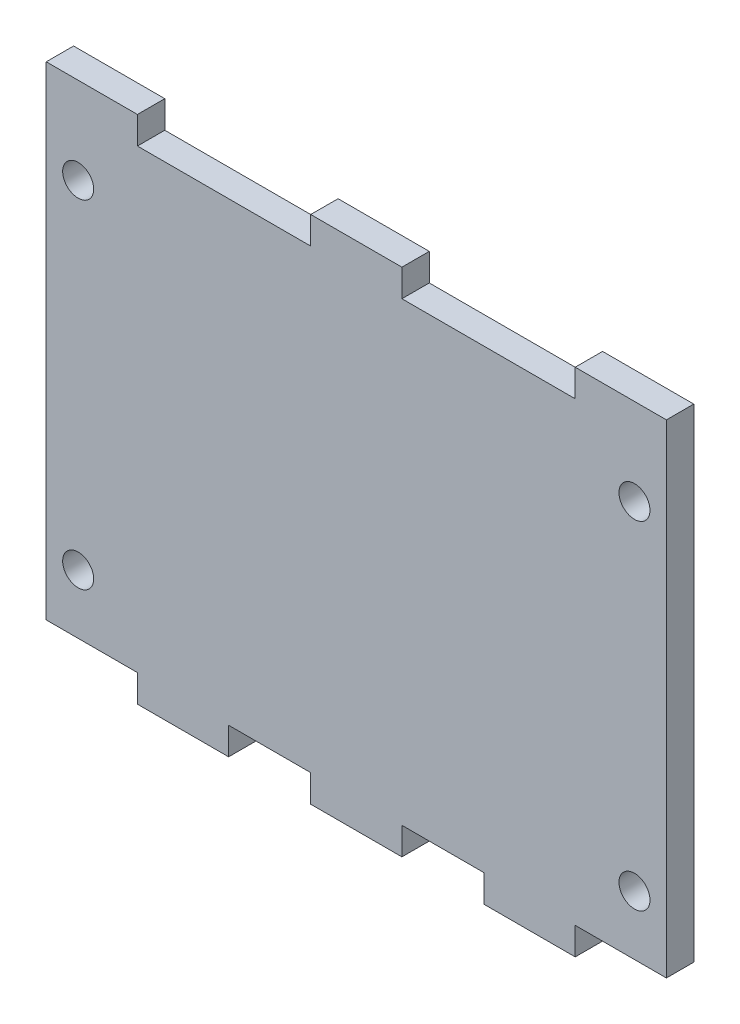
ISO-10303-21;
HEADER;
FILE_DESCRIPTION(('STEP AP214'),'2;1');
FILE_NAME('part.step','',(''),(''),'','','');
FILE_SCHEMA(('AUTOMOTIVE_DESIGN { 1 0 10303 214 1 1 1 1 }'));
ENDSEC;
DATA;
#1=APPLICATION_CONTEXT('core data for automotive mechanical design processes');
#2=APPLICATION_PROTOCOL_DEFINITION('international standard','automotive_design',2000,#1);
#3=PRODUCT_CONTEXT('',#1,'mechanical');
#4=PRODUCT('Part','Part','',(#3));
#5=PRODUCT_RELATED_PRODUCT_CATEGORY('part','',(#4));
#6=PRODUCT_DEFINITION_FORMATION('','',#4);
#7=PRODUCT_DEFINITION_CONTEXT('part definition',#1,'design');
#8=PRODUCT_DEFINITION('design','',#6,#7);
#9=PRODUCT_DEFINITION_SHAPE('','',#8);
#10=(LENGTH_UNIT() NAMED_UNIT(*) SI_UNIT(.MILLI.,.METRE.));
#11=(NAMED_UNIT(*) PLANE_ANGLE_UNIT() SI_UNIT($,.RADIAN.));
#12=(NAMED_UNIT(*) SI_UNIT($,.STERADIAN.) SOLID_ANGLE_UNIT());
#13=UNCERTAINTY_MEASURE_WITH_UNIT(LENGTH_MEASURE(1.E-05),#10,'distance_accuracy_value','');
#14=(GEOMETRIC_REPRESENTATION_CONTEXT(3) GLOBAL_UNCERTAINTY_ASSIGNED_CONTEXT((#13)) GLOBAL_UNIT_ASSIGNED_CONTEXT((#10,
#11,#12)) REPRESENTATION_CONTEXT('',''));
#15=CARTESIAN_POINT('',(0.,0.,0.));
#16=DIRECTION('',(0.,0.,1.));
#17=DIRECTION('',(1.,0.,0.));
#18=AXIS2_PLACEMENT_3D('',#15,#16,#17);
#19=CARTESIAN_POINT('',(34.,-53.,-53.));
#20=DIRECTION('',(0.,-1.,0.));
#21=DIRECTION('',(0.,0.,-1.));
#22=AXIS2_PLACEMENT_3D('',#19,#20,#21);
#23=PLANE('',#22);
#24=DIRECTION('',(1.,0.,0.));
#25=VECTOR('',#24,1.);
#26=CARTESIAN_POINT('',(34.,-53.,-50.));
#27=LINE('',#26,#25);
#28=CARTESIAN_POINT('',(-14.,-53.,-50.));
#29=VERTEX_POINT('',#28);
#30=CARTESIAN_POINT('',(-5.,-53.,-50.));
#31=VERTEX_POINT('',#30);
#32=EDGE_CURVE('E124',#29,#31,#27,.T.);
#33=ORIENTED_EDGE('',*,*,#32,.F.);
#34=CARTESIAN_POINT('',(-14.,-53.,-50.));
#35=CARTESIAN_POINT('',(-14.,-53.,-53.));
#36=B_SPLINE_CURVE_WITH_KNOTS('',1,(#34,#35),.UNSPECIFIED.,.F.,.F.,(2,2),(0.,0.115384615384615),.UNSPECIFIED.);
#37=CARTESIAN_POINT('',(-14.,-53.,-53.));
#38=VERTEX_POINT('',#37);
#39=EDGE_CURVE('E284',#29,#38,#36,.T.);
#40=ORIENTED_EDGE('',*,*,#39,.T.);
#41=DIRECTION('',(1.,0.,0.));
#42=VECTOR('',#41,1.);
#43=CARTESIAN_POINT('',(34.,-53.,-53.));
#44=LINE('',#43,#42);
#45=CARTESIAN_POINT('',(-5.,-53.,-53.));
#46=VERTEX_POINT('',#45);
#47=EDGE_CURVE('E497',#38,#46,#44,.T.);
#48=ORIENTED_EDGE('',*,*,#47,.T.);
#49=CARTESIAN_POINT('',(-5.,-53.,-53.));
#50=CARTESIAN_POINT('',(-5.,-53.,-50.));
#51=B_SPLINE_CURVE_WITH_KNOTS('',1,(#49,#50),.UNSPECIFIED.,.F.,.F.,(2,2),(0.5,
0.615384615384615),.UNSPECIFIED.);
#52=EDGE_CURVE('E298',#46,#31,#51,.T.);
#53=ORIENTED_EDGE('',*,*,#52,.T.);
#54=EDGE_LOOP('',(#33,#40,#48,#53));
#55=FACE_BOUND('',#54,.T.);
#56=ADVANCED_FACE('F101',(#55),#23,.T.);
#57=CARTESIAN_POINT('',(-34.,-53.,-53.));
#58=VERTEX_POINT('',#57);
#59=CARTESIAN_POINT('',(-24.,-53.,-53.));
#60=VERTEX_POINT('',#59);
#61=EDGE_CURVE('E494',#58,#60,#44,.T.);
#62=ORIENTED_EDGE('',*,*,#61,.T.);
#63=CARTESIAN_POINT('',(-24.,-53.,-53.));
#64=CARTESIAN_POINT('',(-24.,-53.,-50.));
#65=B_SPLINE_CURVE_WITH_KNOTS('',1,(#63,#64),.UNSPECIFIED.,.F.,.F.,(2,2),(0.5,
0.615384615384615),.UNSPECIFIED.);
#66=CARTESIAN_POINT('',(-24.,-53.,-50.));
#67=VERTEX_POINT('',#66);
#68=EDGE_CURVE('E274',#60,#67,#65,.T.);
#69=ORIENTED_EDGE('',*,*,#68,.T.);
#70=CARTESIAN_POINT('',(-34.,-53.,-50.));
#71=VERTEX_POINT('',#70);
#72=EDGE_CURVE('E505',#71,#67,#27,.T.);
#73=ORIENTED_EDGE('',*,*,#72,.F.);
#74=DIRECTION('',(0.,0.,1.));
#75=VECTOR('',#74,1.);
#76=CARTESIAN_POINT('',(-34.,-53.,-53.));
#77=LINE('',#76,#75);
#78=EDGE_CURVE('E105',#58,#71,#77,.T.);
#79=ORIENTED_EDGE('',*,*,#78,.F.);
#80=EDGE_LOOP('',(#62,#69,#73,#79));
#81=FACE_BOUND('',#80,.T.);
#82=ADVANCED_FACE('F527',(#81),#23,.T.);
#83=CARTESIAN_POINT('',(5.,-53.,-50.));
#84=VERTEX_POINT('',#83);
#85=CARTESIAN_POINT('',(14.,-53.,-50.));
#86=VERTEX_POINT('',#85);
#87=EDGE_CURVE('E578',#84,#86,#27,.T.);
#88=ORIENTED_EDGE('',*,*,#87,.F.);
#89=CARTESIAN_POINT('',(5.,-53.,-50.));
#90=CARTESIAN_POINT('',(5.,-53.,-53.));
#91=B_SPLINE_CURVE_WITH_KNOTS('',1,(#89,#90),.UNSPECIFIED.,.F.,.F.,(2,2),(0.,0.115384615384615),.UNSPECIFIED.);
#92=CARTESIAN_POINT('',(5.,-53.,-53.));
#93=VERTEX_POINT('',#92);
#94=EDGE_CURVE('E297',#84,#93,#91,.T.);
#95=ORIENTED_EDGE('',*,*,#94,.T.);
#96=CARTESIAN_POINT('',(14.,-53.,-53.));
#97=VERTEX_POINT('',#96);
#98=EDGE_CURVE('E560',#93,#97,#44,.T.);
#99=ORIENTED_EDGE('',*,*,#98,.T.);
#100=CARTESIAN_POINT('',(14.,-53.,-53.));
#101=CARTESIAN_POINT('',(14.,-53.,-50.));
#102=B_SPLINE_CURVE_WITH_KNOTS('',1,(#100,#101),.UNSPECIFIED.,.F.,.F.,(2,2),(0.5,
0.615384615384615),.UNSPECIFIED.);
#103=EDGE_CURVE('E335',#97,#86,#102,.T.);
#104=ORIENTED_EDGE('',*,*,#103,.T.);
#105=EDGE_LOOP('',(#88,#95,#99,#104));
#106=FACE_BOUND('',#105,.T.);
#107=ADVANCED_FACE('F579',(#106),#23,.T.);
#108=CARTESIAN_POINT('',(24.,-53.,-50.));
#109=VERTEX_POINT('',#108);
#110=CARTESIAN_POINT('',(34.,-53.,-50.));
#111=VERTEX_POINT('',#110);
#112=EDGE_CURVE('E504',#109,#111,#27,.T.);
#113=ORIENTED_EDGE('',*,*,#112,.F.);
#114=CARTESIAN_POINT('',(24.,-53.,-50.));
#115=CARTESIAN_POINT('',(24.,-53.,-53.));
#116=B_SPLINE_CURVE_WITH_KNOTS('',1,(#114,#115),.UNSPECIFIED.,.F.,.F.,(2,2),(0.,
0.115384615384615),.UNSPECIFIED.);
#117=CARTESIAN_POINT('',(24.,-53.,-53.));
#118=VERTEX_POINT('',#117);
#119=EDGE_CURVE('E334',#109,#118,#116,.T.);
#120=ORIENTED_EDGE('',*,*,#119,.T.);
#121=CARTESIAN_POINT('',(34.,-53.,-53.));
#122=VERTEX_POINT('',#121);
#123=EDGE_CURVE('E492',#118,#122,#44,.T.);
#124=ORIENTED_EDGE('',*,*,#123,.T.);
#125=DIRECTION('',(0.,0.,1.));
#126=VECTOR('',#125,1.);
#127=CARTESIAN_POINT('',(34.,-53.,-53.));
#128=LINE('',#127,#126);
#129=EDGE_CURVE('E13',#122,#111,#128,.T.);
#130=ORIENTED_EDGE('',*,*,#129,.T.);
#131=EDGE_LOOP('',(#113,#120,#124,#130));
#132=FACE_BOUND('',#131,.T.);
#133=ADVANCED_FACE('F558',(#132),#23,.T.);
#134=CARTESIAN_POINT('',(34.,-3.,-53.));
#135=DIRECTION('',(0.,1.,0.));
#136=DIRECTION('',(0.,0.,1.));
#137=AXIS2_PLACEMENT_3D('',#134,#135,#136);
#138=PLANE('',#137);
#139=CARTESIAN_POINT('',(5.,-3.,-50.));
#140=CARTESIAN_POINT('',(5.,-3.,-53.));
#141=B_SPLINE_CURVE_WITH_KNOTS('',1,(#139,#140),.UNSPECIFIED.,.F.,.F.,(2,2),(0.,
0.115384615384615),.UNSPECIFIED.);
#142=CARTESIAN_POINT('',(5.,-3.,-50.));
#143=VERTEX_POINT('',#142);
#144=CARTESIAN_POINT('',(5.,-3.,-53.));
#145=VERTEX_POINT('',#144);
#146=EDGE_CURVE('E406',#143,#145,#141,.T.);
#147=ORIENTED_EDGE('',*,*,#146,.F.);
#148=DIRECTION('',(-1.,0.,0.));
#149=VECTOR('',#148,1.);
#150=CARTESIAN_POINT('',(34.,-3.,-50.));
#151=LINE('',#150,#149);
#152=CARTESIAN_POINT('',(24.,-3.,-50.));
#153=VERTEX_POINT('',#152);
#154=EDGE_CURVE('E493',#153,#143,#151,.T.);
#155=ORIENTED_EDGE('',*,*,#154,.F.);
#156=CARTESIAN_POINT('',(24.,-3.,-53.));
#157=CARTESIAN_POINT('',(24.,-3.,-50.));
#158=B_SPLINE_CURVE_WITH_KNOTS('',1,(#156,#157),.UNSPECIFIED.,.F.,.F.,(2,2),(0.5,
0.615384615384615),.UNSPECIFIED.);
#159=CARTESIAN_POINT('',(24.,-3.,-53.));
#160=VERTEX_POINT('',#159);
#161=EDGE_CURVE('E439',#160,#153,#158,.T.);
#162=ORIENTED_EDGE('',*,*,#161,.F.);
#163=DIRECTION('',(-1.,0.,0.));
#164=VECTOR('',#163,1.);
#165=CARTESIAN_POINT('',(34.,-3.,-53.));
#166=LINE('',#165,#164);
#167=EDGE_CURVE('E500',#160,#145,#166,.T.);
#168=ORIENTED_EDGE('',*,*,#167,.T.);
#169=EDGE_LOOP('',(#147,#155,#162,#168));
#170=FACE_BOUND('',#169,.T.);
#171=ADVANCED_FACE('F540',(#170),#138,.T.);
#172=CARTESIAN_POINT('',(-34.,-3.,-53.));
#173=DIRECTION('',(-1.,0.,0.));
#174=DIRECTION('',(0.,0.,1.));
#175=AXIS2_PLACEMENT_3D('',#172,#173,#174);
#176=PLANE('',#175);
#177=DIRECTION('',(0.,-1.,0.));
#178=VECTOR('',#177,1.);
#179=CARTESIAN_POINT('',(-34.,-3.,-50.));
#180=LINE('',#179,#178);
#181=CARTESIAN_POINT('',(-34.,0.,-50.));
#182=VERTEX_POINT('',#181);
#183=EDGE_CURVE('E488',#182,#71,#180,.T.);
#184=ORIENTED_EDGE('',*,*,#183,.F.);
#185=DIRECTION('',(0.,0.,1.));
#186=VECTOR('',#185,1.);
#187=CARTESIAN_POINT('',(-34.,0.,-53.));
#188=LINE('',#187,#186);
#189=CARTESIAN_POINT('',(-34.,0.,-53.));
#190=VERTEX_POINT('',#189);
#191=EDGE_CURVE('E379',#190,#182,#188,.T.);
#192=ORIENTED_EDGE('',*,*,#191,.F.);
#193=DIRECTION('',(0.,-1.,0.));
#194=VECTOR('',#193,1.);
#195=CARTESIAN_POINT('',(-34.,-3.,-53.));
#196=LINE('',#195,#194);
#197=EDGE_CURVE('E489',#190,#58,#196,.T.);
#198=ORIENTED_EDGE('',*,*,#197,.T.);
#199=ORIENTED_EDGE('',*,*,#78,.T.);
#200=EDGE_LOOP('',(#184,#192,#198,#199));
#201=FACE_BOUND('',#200,.T.);
#202=ADVANCED_FACE('F103',(#201),#176,.T.);
#203=CARTESIAN_POINT('',(-24.,-3.,-50.));
#204=CARTESIAN_POINT('',(-24.,-3.,-53.));
#205=B_SPLINE_CURVE_WITH_KNOTS('',1,(#203,#204),.UNSPECIFIED.,.F.,.F.,(2,2),(0.,
0.115384615384615),.UNSPECIFIED.);
#206=CARTESIAN_POINT('',(-24.,-3.,-50.));
#207=VERTEX_POINT('',#206);
#208=CARTESIAN_POINT('',(-24.,-3.,-53.));
#209=VERTEX_POINT('',#208);
#210=EDGE_CURVE('E373',#207,#209,#205,.T.);
#211=ORIENTED_EDGE('',*,*,#210,.F.);
#212=CARTESIAN_POINT('',(-5.,-3.,-50.));
#213=VERTEX_POINT('',#212);
#214=EDGE_CURVE('E510',#213,#207,#151,.T.);
#215=ORIENTED_EDGE('',*,*,#214,.F.);
#216=CARTESIAN_POINT('',(-5.,-3.,-53.));
#217=CARTESIAN_POINT('',(-5.,-3.,-50.));
#218=B_SPLINE_CURVE_WITH_KNOTS('',1,(#216,#217),.UNSPECIFIED.,.F.,.F.,(2,2),(0.5,
0.615384615384615),.UNSPECIFIED.);
#219=CARTESIAN_POINT('',(-5.,-3.,-53.));
#220=VERTEX_POINT('',#219);
#221=EDGE_CURVE('E399',#220,#213,#218,.T.);
#222=ORIENTED_EDGE('',*,*,#221,.F.);
#223=EDGE_CURVE('E499',#220,#209,#166,.T.);
#224=ORIENTED_EDGE('',*,*,#223,.T.);
#225=EDGE_LOOP('',(#211,#215,#222,#224));
#226=FACE_BOUND('',#225,.T.);
#227=ADVANCED_FACE('F609',(#226),#138,.T.);
#228=CARTESIAN_POINT('',(34.,-3.,-53.));
#229=DIRECTION('',(1.,0.,0.));
#230=DIRECTION('',(0.,0.,-1.));
#231=AXIS2_PLACEMENT_3D('',#228,#229,#230);
#232=PLANE('',#231);
#233=DIRECTION('',(0.,1.,0.));
#234=VECTOR('',#233,1.);
#235=CARTESIAN_POINT('',(34.,-3.,-50.));
#236=LINE('',#235,#234);
#237=CARTESIAN_POINT('',(34.,0.,-50.));
#238=VERTEX_POINT('',#237);
#239=EDGE_CURVE('E508',#111,#238,#236,.T.);
#240=ORIENTED_EDGE('',*,*,#239,.F.);
#241=ORIENTED_EDGE('',*,*,#129,.F.);
#242=DIRECTION('',(0.,1.,0.));
#243=VECTOR('',#242,1.);
#244=CARTESIAN_POINT('',(34.,-3.,-53.));
#245=LINE('',#244,#243);
#246=CARTESIAN_POINT('',(34.,0.,-53.));
#247=VERTEX_POINT('',#246);
#248=EDGE_CURVE('E496',#122,#247,#245,.T.);
#249=ORIENTED_EDGE('',*,*,#248,.T.);
#250=DIRECTION('',(0.,0.,-1.));
#251=VECTOR('',#250,1.);
#252=CARTESIAN_POINT('',(34.,0.,-50.));
#253=LINE('',#252,#251);
#254=EDGE_CURVE('E455',#238,#247,#253,.T.);
#255=ORIENTED_EDGE('',*,*,#254,.F.);
#256=EDGE_LOOP('',(#240,#241,#249,#255));
#257=FACE_BOUND('',#256,.T.);
#258=ADVANCED_FACE('F555',(#257),#232,.T.);
#259=CARTESIAN_POINT('',(0.,0.,-53.));
#260=DIRECTION('',(0.,0.,-1.));
#261=DIRECTION('',(-1.,0.,0.));
#262=AXIS2_PLACEMENT_3D('',#259,#260,#261);
#263=PLANE('',#262);
#264=CARTESIAN_POINT('',(-30.5,-46.5,-53.));
#265=DIRECTION('',(0.,0.,1.));
#266=DIRECTION('',(1.,0.,0.));
#267=AXIS2_PLACEMENT_3D('',#264,#265,#266);
#268=CIRCLE('',#267,1.7);
#269=CARTESIAN_POINT('',(-28.8,-46.5,-53.));
#270=VERTEX_POINT('',#269);
#271=EDGE_CURVE('E467',#270,#270,#268,.T.);
#272=ORIENTED_EDGE('',*,*,#271,.T.);
#273=EDGE_LOOP('',(#272));
#274=FACE_BOUND('',#273,.T.);
#275=CARTESIAN_POINT('',(-30.5,-9.50000000000001,-53.));
#276=DIRECTION('',(0.,0.,1.));
#277=DIRECTION('',(1.,0.,0.));
#278=AXIS2_PLACEMENT_3D('',#275,#276,#277);
#279=CIRCLE('',#278,1.7);
#280=CARTESIAN_POINT('',(-28.8,-9.50000000000001,-53.));
#281=VERTEX_POINT('',#280);
#282=EDGE_CURVE('E473',#281,#281,#279,.T.);
#283=ORIENTED_EDGE('',*,*,#282,.T.);
#284=EDGE_LOOP('',(#283));
#285=FACE_BOUND('',#284,.T.);
#286=CARTESIAN_POINT('',(30.5,-9.50000000000001,-53.));
#287=DIRECTION('',(0.,0.,1.));
#288=DIRECTION('',(1.,0.,0.));
#289=AXIS2_PLACEMENT_3D('',#286,#287,#288);
#290=CIRCLE('',#289,1.7);
#291=CARTESIAN_POINT('',(32.2,-9.50000000000001,-53.));
#292=VERTEX_POINT('',#291);
#293=EDGE_CURVE('E479',#292,#292,#290,.T.);
#294=ORIENTED_EDGE('',*,*,#293,.T.);
#295=EDGE_LOOP('',(#294));
#296=FACE_BOUND('',#295,.T.);
#297=CARTESIAN_POINT('',(30.5,-46.5,-53.));
#298=DIRECTION('',(0.,0.,1.));
#299=DIRECTION('',(1.,0.,0.));
#300=AXIS2_PLACEMENT_3D('',#297,#298,#299);
#301=CIRCLE('',#300,1.7);
#302=CARTESIAN_POINT('',(32.2,-46.5,-53.));
#303=VERTEX_POINT('',#302);
#304=EDGE_CURVE('E485',#303,#303,#301,.T.);
#305=ORIENTED_EDGE('',*,*,#304,.T.);
#306=EDGE_LOOP('',(#305));
#307=FACE_BOUND('',#306,.T.);
#308=ORIENTED_EDGE('',*,*,#197,.F.);
#309=DIRECTION('',(-1.,0.,0.));
#310=VECTOR('',#309,1.);
#311=CARTESIAN_POINT('',(-24.,0.,-53.));
#312=LINE('',#311,#310);
#313=CARTESIAN_POINT('',(-24.,0.,-53.));
#314=VERTEX_POINT('',#313);
#315=EDGE_CURVE('E386',#314,#190,#312,.T.);
#316=ORIENTED_EDGE('',*,*,#315,.F.);
#317=DIRECTION('',(0.,-1.,0.));
#318=VECTOR('',#317,1.);
#319=CARTESIAN_POINT('',(-24.,3.,-53.));
#320=LINE('',#319,#318);
#321=EDGE_CURVE('E378',#314,#209,#320,.T.);
#322=ORIENTED_EDGE('',*,*,#321,.T.);
#323=ORIENTED_EDGE('',*,*,#223,.F.);
#324=DIRECTION('',(0.,-1.,0.));
#325=VECTOR('',#324,1.);
#326=CARTESIAN_POINT('',(-5.,3.,-53.));
#327=LINE('',#326,#325);
#328=CARTESIAN_POINT('',(-5.,0.,-53.));
#329=VERTEX_POINT('',#328);
#330=EDGE_CURVE('E405',#329,#220,#327,.T.);
#331=ORIENTED_EDGE('',*,*,#330,.F.);
#332=DIRECTION('',(-1.,0.,0.));
#333=VECTOR('',#332,1.);
#334=CARTESIAN_POINT('',(5.,0.,-53.));
#335=LINE('',#334,#333);
#336=CARTESIAN_POINT('',(5.,0.,-53.));
#337=VERTEX_POINT('',#336);
#338=EDGE_CURVE('E422',#337,#329,#335,.T.);
#339=ORIENTED_EDGE('',*,*,#338,.F.);
#340=DIRECTION('',(0.,-1.,0.));
#341=VECTOR('',#340,1.);
#342=CARTESIAN_POINT('',(5.,3.,-53.));
#343=LINE('',#342,#341);
#344=EDGE_CURVE('E414',#337,#145,#343,.T.);
#345=ORIENTED_EDGE('',*,*,#344,.T.);
#346=ORIENTED_EDGE('',*,*,#167,.F.);
#347=DIRECTION('',(0.,-1.,0.));
#348=VECTOR('',#347,1.);
#349=CARTESIAN_POINT('',(24.,3.,-53.));
#350=LINE('',#349,#348);
#351=CARTESIAN_POINT('',(24.,0.,-53.));
#352=VERTEX_POINT('',#351);
#353=EDGE_CURVE('E421',#352,#160,#350,.T.);
#354=ORIENTED_EDGE('',*,*,#353,.F.);
#355=DIRECTION('',(-1.,0.,0.));
#356=VECTOR('',#355,1.);
#357=CARTESIAN_POINT('',(34.,0.,-53.));
#358=LINE('',#357,#356);
#359=EDGE_CURVE('E452',#247,#352,#358,.T.);
#360=ORIENTED_EDGE('',*,*,#359,.F.);
#361=ORIENTED_EDGE('',*,*,#248,.F.);
#362=ORIENTED_EDGE('',*,*,#123,.F.);
#363=DIRECTION('',(0.,1.,0.));
#364=VECTOR('',#363,1.);
#365=CARTESIAN_POINT('',(24.,-59.,-53.));
#366=LINE('',#365,#364);
#367=CARTESIAN_POINT('',(24.,-56.,-53.));
#368=VERTEX_POINT('',#367);
#369=EDGE_CURVE('E357',#368,#118,#366,.T.);
#370=ORIENTED_EDGE('',*,*,#369,.F.);
#371=DIRECTION('',(-1.,0.,0.));
#372=VECTOR('',#371,1.);
#373=CARTESIAN_POINT('',(24.,-56.,-53.));
#374=LINE('',#373,#372);
#375=CARTESIAN_POINT('',(14.,-56.,-53.));
#376=VERTEX_POINT('',#375);
#377=EDGE_CURVE('E340',#368,#376,#374,.T.);
#378=ORIENTED_EDGE('',*,*,#377,.T.);
#379=DIRECTION('',(0.,1.,0.));
#380=VECTOR('',#379,1.);
#381=CARTESIAN_POINT('',(14.,-59.,-53.));
#382=LINE('',#381,#380);
#383=EDGE_CURVE('E353',#376,#97,#382,.T.);
#384=ORIENTED_EDGE('',*,*,#383,.T.);
#385=ORIENTED_EDGE('',*,*,#98,.F.);
#386=DIRECTION('',(0.,1.,0.));
#387=VECTOR('',#386,1.);
#388=CARTESIAN_POINT('',(5.,-59.,-53.));
#389=LINE('',#388,#387);
#390=CARTESIAN_POINT('',(5.,-56.,-53.));
#391=VERTEX_POINT('',#390);
#392=EDGE_CURVE('E320',#391,#93,#389,.T.);
#393=ORIENTED_EDGE('',*,*,#392,.F.);
#394=DIRECTION('',(-1.,0.,0.));
#395=VECTOR('',#394,1.);
#396=CARTESIAN_POINT('',(5.,-56.,-53.));
#397=LINE('',#396,#395);
#398=CARTESIAN_POINT('',(-5.,-56.,-53.));
#399=VERTEX_POINT('',#398);
#400=EDGE_CURVE('E303',#391,#399,#397,.T.);
#401=ORIENTED_EDGE('',*,*,#400,.T.);
#402=DIRECTION('',(0.,1.,0.));
#403=VECTOR('',#402,1.);
#404=CARTESIAN_POINT('',(-5.,-59.,-53.));
#405=LINE('',#404,#403);
#406=EDGE_CURVE('E316',#399,#46,#405,.T.);
#407=ORIENTED_EDGE('',*,*,#406,.T.);
#408=ORIENTED_EDGE('',*,*,#47,.F.);
#409=DIRECTION('',(0.,1.,0.));
#410=VECTOR('',#409,1.);
#411=CARTESIAN_POINT('',(-14.,-59.,-53.));
#412=LINE('',#411,#410);
#413=CARTESIAN_POINT('',(-14.,-56.,-53.));
#414=VERTEX_POINT('',#413);
#415=EDGE_CURVE('E282',#414,#38,#412,.T.);
#416=ORIENTED_EDGE('',*,*,#415,.F.);
#417=DIRECTION('',(-1.,0.,0.));
#418=VECTOR('',#417,1.);
#419=CARTESIAN_POINT('',(-14.,-56.,-53.));
#420=LINE('',#419,#418);
#421=CARTESIAN_POINT('',(-24.,-56.,-53.));
#422=VERTEX_POINT('',#421);
#423=EDGE_CURVE('E267',#414,#422,#420,.T.);
#424=ORIENTED_EDGE('',*,*,#423,.T.);
#425=DIRECTION('',(0.,1.,0.));
#426=VECTOR('',#425,1.);
#427=CARTESIAN_POINT('',(-24.,-59.,-53.));
#428=LINE('',#427,#426);
#429=EDGE_CURVE('E271',#422,#60,#428,.T.);
#430=ORIENTED_EDGE('',*,*,#429,.T.);
#431=ORIENTED_EDGE('',*,*,#61,.F.);
#432=EDGE_LOOP('',(#308,#316,#322,#323,#331,#339,#345,#346,#354,#360,#361,#362,#370,#378,#384,
#385,#393,#401,#407,#408,#416,#424,#430,#431));
#433=FACE_BOUND('',#432,.T.);
#434=ADVANCED_FACE('F280',(#274,#285,#296,#307,#433),#263,.T.);
#435=CARTESIAN_POINT('',(0.,0.,-50.));
#436=DIRECTION('',(0.,0.,-1.));
#437=DIRECTION('',(-1.,0.,0.));
#438=AXIS2_PLACEMENT_3D('',#435,#436,#437);
#439=PLANE('',#438);
#440=CARTESIAN_POINT('',(-30.5,-46.5,-50.));
#441=DIRECTION('',(0.,0.,1.));
#442=DIRECTION('',(1.,0.,0.));
#443=AXIS2_PLACEMENT_3D('',#440,#441,#442);
#444=CIRCLE('',#443,1.69999999999999);
#445=CARTESIAN_POINT('',(-28.8,-46.5,-50.));
#446=VERTEX_POINT('',#445);
#447=EDGE_CURVE('E451',#446,#446,#444,.T.);
#448=ORIENTED_EDGE('',*,*,#447,.F.);
#449=EDGE_LOOP('',(#448));
#450=FACE_BOUND('',#449,.T.);
#451=CARTESIAN_POINT('',(-30.5,-9.50000000000001,-50.));
#452=DIRECTION('',(0.,0.,1.));
#453=DIRECTION('',(1.,0.,0.));
#454=AXIS2_PLACEMENT_3D('',#451,#452,#453);
#455=CIRCLE('',#454,1.69999999999999);
#456=CARTESIAN_POINT('',(-28.8,-9.50000000000001,-50.));
#457=VERTEX_POINT('',#456);
#458=EDGE_CURVE('E470',#457,#457,#455,.T.);
#459=ORIENTED_EDGE('',*,*,#458,.F.);
#460=EDGE_LOOP('',(#459));
#461=FACE_BOUND('',#460,.T.);
#462=CARTESIAN_POINT('',(30.5,-9.50000000000001,-50.));
#463=DIRECTION('',(0.,0.,1.));
#464=DIRECTION('',(1.,0.,0.));
#465=AXIS2_PLACEMENT_3D('',#462,#463,#464);
#466=CIRCLE('',#465,1.69999999999999);
#467=CARTESIAN_POINT('',(32.2,-9.50000000000001,-50.));
#468=VERTEX_POINT('',#467);
#469=EDGE_CURVE('E476',#468,#468,#466,.T.);
#470=ORIENTED_EDGE('',*,*,#469,.F.);
#471=EDGE_LOOP('',(#470));
#472=FACE_BOUND('',#471,.T.);
#473=CARTESIAN_POINT('',(30.5,-46.5,-50.));
#474=DIRECTION('',(0.,0.,1.));
#475=DIRECTION('',(1.,0.,0.));
#476=AXIS2_PLACEMENT_3D('',#473,#474,#475);
#477=CIRCLE('',#476,1.69999999999999);
#478=CARTESIAN_POINT('',(32.2,-46.5,-50.));
#479=VERTEX_POINT('',#478);
#480=EDGE_CURVE('E482',#479,#479,#477,.T.);
#481=ORIENTED_EDGE('',*,*,#480,.F.);
#482=EDGE_LOOP('',(#481));
#483=FACE_BOUND('',#482,.T.);
#484=ORIENTED_EDGE('',*,*,#183,.T.);
#485=ORIENTED_EDGE('',*,*,#72,.T.);
#486=DIRECTION('',(0.,1.,0.));
#487=VECTOR('',#486,1.);
#488=CARTESIAN_POINT('',(-24.,-59.,-50.));
#489=LINE('',#488,#487);
#490=CARTESIAN_POINT('',(-24.,-56.,-50.));
#491=VERTEX_POINT('',#490);
#492=EDGE_CURVE('E116',#491,#67,#489,.T.);
#493=ORIENTED_EDGE('',*,*,#492,.F.);
#494=DIRECTION('',(1.,0.,0.));
#495=VECTOR('',#494,1.);
#496=CARTESIAN_POINT('',(-24.,-56.,-50.));
#497=LINE('',#496,#495);
#498=CARTESIAN_POINT('',(-14.,-56.,-50.));
#499=VERTEX_POINT('',#498);
#500=EDGE_CURVE('E270',#491,#499,#497,.T.);
#501=ORIENTED_EDGE('',*,*,#500,.T.);
#502=DIRECTION('',(0.,1.,0.));
#503=VECTOR('',#502,1.);
#504=CARTESIAN_POINT('',(-14.,-59.,-50.));
#505=LINE('',#504,#503);
#506=EDGE_CURVE('E292',#499,#29,#505,.T.);
#507=ORIENTED_EDGE('',*,*,#506,.T.);
#508=ORIENTED_EDGE('',*,*,#32,.T.);
#509=DIRECTION('',(0.,1.,0.));
#510=VECTOR('',#509,1.);
#511=CARTESIAN_POINT('',(-5.,-59.,-50.));
#512=LINE('',#511,#510);
#513=CARTESIAN_POINT('',(-5.,-56.,-50.));
#514=VERTEX_POINT('',#513);
#515=EDGE_CURVE('E325',#514,#31,#512,.T.);
#516=ORIENTED_EDGE('',*,*,#515,.F.);
#517=DIRECTION('',(1.,0.,0.));
#518=VECTOR('',#517,1.);
#519=CARTESIAN_POINT('',(-5.,-56.,-50.));
#520=LINE('',#519,#518);
#521=CARTESIAN_POINT('',(5.,-56.,-50.));
#522=VERTEX_POINT('',#521);
#523=EDGE_CURVE('E322',#514,#522,#520,.T.);
#524=ORIENTED_EDGE('',*,*,#523,.T.);
#525=DIRECTION('',(0.,1.,0.));
#526=VECTOR('',#525,1.);
#527=CARTESIAN_POINT('',(5.,-59.,-50.));
#528=LINE('',#527,#526);
#529=EDGE_CURVE('E321',#522,#84,#528,.T.);
#530=ORIENTED_EDGE('',*,*,#529,.T.);
#531=ORIENTED_EDGE('',*,*,#87,.T.);
#532=DIRECTION('',(0.,1.,0.));
#533=VECTOR('',#532,1.);
#534=CARTESIAN_POINT('',(14.,-59.,-50.));
#535=LINE('',#534,#533);
#536=CARTESIAN_POINT('',(14.,-56.,-50.));
#537=VERTEX_POINT('',#536);
#538=EDGE_CURVE('E362',#537,#86,#535,.T.);
#539=ORIENTED_EDGE('',*,*,#538,.F.);
#540=DIRECTION('',(1.,0.,0.));
#541=VECTOR('',#540,1.);
#542=CARTESIAN_POINT('',(14.,-56.,-50.));
#543=LINE('',#542,#541);
#544=CARTESIAN_POINT('',(24.,-56.,-50.));
#545=VERTEX_POINT('',#544);
#546=EDGE_CURVE('E359',#537,#545,#543,.T.);
#547=ORIENTED_EDGE('',*,*,#546,.T.);
#548=DIRECTION('',(0.,1.,0.));
#549=VECTOR('',#548,1.);
#550=CARTESIAN_POINT('',(24.,-59.,-50.));
#551=LINE('',#550,#549);
#552=EDGE_CURVE('E358',#545,#109,#551,.T.);
#553=ORIENTED_EDGE('',*,*,#552,.T.);
#554=ORIENTED_EDGE('',*,*,#112,.T.);
#555=ORIENTED_EDGE('',*,*,#239,.T.);
#556=DIRECTION('',(1.,0.,0.));
#557=VECTOR('',#556,1.);
#558=CARTESIAN_POINT('',(24.,0.,-50.));
#559=LINE('',#558,#557);
#560=CARTESIAN_POINT('',(24.,0.,-50.));
#561=VERTEX_POINT('',#560);
#562=EDGE_CURVE('E458',#561,#238,#559,.T.);
#563=ORIENTED_EDGE('',*,*,#562,.F.);
#564=DIRECTION('',(0.,-1.,0.));
#565=VECTOR('',#564,1.);
#566=CARTESIAN_POINT('',(24.,3.,-50.));
#567=LINE('',#566,#565);
#568=EDGE_CURVE('E444',#561,#153,#567,.T.);
#569=ORIENTED_EDGE('',*,*,#568,.T.);
#570=ORIENTED_EDGE('',*,*,#154,.T.);
#571=DIRECTION('',(0.,-1.,0.));
#572=VECTOR('',#571,1.);
#573=CARTESIAN_POINT('',(5.,3.,-50.));
#574=LINE('',#573,#572);
#575=CARTESIAN_POINT('',(5.,0.,-50.));
#576=VERTEX_POINT('',#575);
#577=EDGE_CURVE('E385',#576,#143,#574,.T.);
#578=ORIENTED_EDGE('',*,*,#577,.F.);
#579=DIRECTION('',(1.,0.,0.));
#580=VECTOR('',#579,1.);
#581=CARTESIAN_POINT('',(-5.,0.,-50.));
#582=LINE('',#581,#580);
#583=CARTESIAN_POINT('',(-5.,0.,-50.));
#584=VERTEX_POINT('',#583);
#585=EDGE_CURVE('E428',#584,#576,#582,.T.);
#586=ORIENTED_EDGE('',*,*,#585,.F.);
#587=DIRECTION('',(0.,-1.,0.));
#588=VECTOR('',#587,1.);
#589=CARTESIAN_POINT('',(-5.,3.,-50.));
#590=LINE('',#589,#588);
#591=EDGE_CURVE('E404',#584,#213,#590,.T.);
#592=ORIENTED_EDGE('',*,*,#591,.T.);
#593=ORIENTED_EDGE('',*,*,#214,.T.);
#594=DIRECTION('',(0.,-1.,0.));
#595=VECTOR('',#594,1.);
#596=CARTESIAN_POINT('',(-24.,3.,-50.));
#597=LINE('',#596,#595);
#598=CARTESIAN_POINT('',(-24.,0.,-50.));
#599=VERTEX_POINT('',#598);
#600=EDGE_CURVE('E372',#599,#207,#597,.T.);
#601=ORIENTED_EDGE('',*,*,#600,.F.);
#602=DIRECTION('',(1.,0.,0.));
#603=VECTOR('',#602,1.);
#604=CARTESIAN_POINT('',(-34.,0.,-50.));
#605=LINE('',#604,#603);
#606=EDGE_CURVE('E392',#182,#599,#605,.T.);
#607=ORIENTED_EDGE('',*,*,#606,.F.);
#608=EDGE_LOOP('',(#484,#485,#493,#501,#507,#508,#516,#524,#530,#531,#539,#547,#553,#554,#555,
#563,#569,#570,#578,#586,#592,#593,#601,#607));
#609=FACE_BOUND('',#608,.T.);
#610=ADVANCED_FACE('F513',(#450,#461,#472,#483,#609),#439,.F.);
#611=CARTESIAN_POINT('',(30.5,-46.5,-50.));
#612=DIRECTION('',(0.,0.,1.));
#613=DIRECTION('',(1.,0.,0.));
#614=AXIS2_PLACEMENT_3D('',#611,#612,#613);
#615=CYLINDRICAL_SURFACE('',#614,1.69999999999999);
#616=ORIENTED_EDGE('',*,*,#304,.F.);
#617=EDGE_LOOP('',(#616));
#618=FACE_BOUND('',#617,.T.);
#619=ORIENTED_EDGE('',*,*,#480,.T.);
#620=EDGE_LOOP('',(#619));
#621=FACE_BOUND('',#620,.T.);
#622=ADVANCED_FACE('F751',(#618,#621),#615,.F.);
#623=CARTESIAN_POINT('',(30.5,-9.50000000000001,-50.));
#624=DIRECTION('',(0.,0.,1.));
#625=DIRECTION('',(1.,0.,0.));
#626=AXIS2_PLACEMENT_3D('',#623,#624,#625);
#627=CYLINDRICAL_SURFACE('',#626,1.69999999999999);
#628=ORIENTED_EDGE('',*,*,#293,.F.);
#629=EDGE_LOOP('',(#628));
#630=FACE_BOUND('',#629,.T.);
#631=ORIENTED_EDGE('',*,*,#469,.T.);
#632=EDGE_LOOP('',(#631));
#633=FACE_BOUND('',#632,.T.);
#634=ADVANCED_FACE('F740',(#630,#633),#627,.F.);
#635=CARTESIAN_POINT('',(-30.5,-9.50000000000001,-50.));
#636=DIRECTION('',(0.,0.,1.));
#637=DIRECTION('',(1.,0.,0.));
#638=AXIS2_PLACEMENT_3D('',#635,#636,#637);
#639=CYLINDRICAL_SURFACE('',#638,1.69999999999999);
#640=ORIENTED_EDGE('',*,*,#282,.F.);
#641=EDGE_LOOP('',(#640));
#642=FACE_BOUND('',#641,.T.);
#643=ORIENTED_EDGE('',*,*,#458,.T.);
#644=EDGE_LOOP('',(#643));
#645=FACE_BOUND('',#644,.T.);
#646=ADVANCED_FACE('F730',(#642,#645),#639,.F.);
#647=CARTESIAN_POINT('',(-30.5,-46.5,-50.));
#648=DIRECTION('',(0.,0.,1.));
#649=DIRECTION('',(1.,0.,0.));
#650=AXIS2_PLACEMENT_3D('',#647,#648,#649);
#651=CYLINDRICAL_SURFACE('',#650,1.69999999999999);
#652=ORIENTED_EDGE('',*,*,#271,.F.);
#653=EDGE_LOOP('',(#652));
#654=FACE_BOUND('',#653,.T.);
#655=ORIENTED_EDGE('',*,*,#447,.T.);
#656=EDGE_LOOP('',(#655));
#657=FACE_BOUND('',#656,.T.);
#658=ADVANCED_FACE('F686',(#654,#657),#651,.F.);
#659=CARTESIAN_POINT('',(24.,3.,-53.));
#660=DIRECTION('',(1.,0.,0.));
#661=DIRECTION('',(0.,0.,-1.));
#662=AXIS2_PLACEMENT_3D('',#659,#660,#661);
#663=PLANE('',#662);
#664=DIRECTION('',(0.,0.,1.));
#665=VECTOR('',#664,1.);
#666=CARTESIAN_POINT('',(24.,0.,-53.));
#667=LINE('',#666,#665);
#668=EDGE_CURVE('E445',#352,#561,#667,.T.);
#669=ORIENTED_EDGE('',*,*,#668,.F.);
#670=ORIENTED_EDGE('',*,*,#353,.T.);
#671=ORIENTED_EDGE('',*,*,#161,.T.);
#672=ORIENTED_EDGE('',*,*,#568,.F.);
#673=EDGE_LOOP('',(#669,#670,#671,#672));
#674=FACE_BOUND('',#673,.T.);
#675=ADVANCED_FACE('F544',(#674),#663,.F.);
#676=CARTESIAN_POINT('',(0.,0.,0.));
#677=DIRECTION('',(0.,1.,0.));
#678=DIRECTION('',(-1.,0.,0.));
#679=AXIS2_PLACEMENT_3D('',#676,#677,#678);
#680=PLANE('',#679);
#681=ORIENTED_EDGE('',*,*,#562,.T.);
#682=ORIENTED_EDGE('',*,*,#254,.T.);
#683=ORIENTED_EDGE('',*,*,#359,.T.);
#684=ORIENTED_EDGE('',*,*,#668,.T.);
#685=EDGE_LOOP('',(#681,#682,#683,#684));
#686=FACE_BOUND('',#685,.T.);
#687=ADVANCED_FACE('F547',(#686),#680,.T.);
#688=CARTESIAN_POINT('',(5.,3.,-50.));
#689=DIRECTION('',(-1.,0.,0.));
#690=DIRECTION('',(0.,0.,1.));
#691=AXIS2_PLACEMENT_3D('',#688,#689,#690);
#692=PLANE('',#691);
#693=DIRECTION('',(0.,0.,-1.));
#694=VECTOR('',#693,1.);
#695=CARTESIAN_POINT('',(5.,0.,-50.));
#696=LINE('',#695,#694);
#697=EDGE_CURVE('E425',#576,#337,#696,.T.);
#698=ORIENTED_EDGE('',*,*,#697,.F.);
#699=ORIENTED_EDGE('',*,*,#577,.T.);
#700=ORIENTED_EDGE('',*,*,#146,.T.);
#701=ORIENTED_EDGE('',*,*,#344,.F.);
#702=EDGE_LOOP('',(#698,#699,#700,#701));
#703=FACE_BOUND('',#702,.T.);
#704=ADVANCED_FACE('F538',(#703),#692,.F.);
#705=CARTESIAN_POINT('',(-5.,3.,-53.));
#706=DIRECTION('',(1.,0.,0.));
#707=DIRECTION('',(0.,0.,-1.));
#708=AXIS2_PLACEMENT_3D('',#705,#706,#707);
#709=PLANE('',#708);
#710=DIRECTION('',(0.,0.,1.));
#711=VECTOR('',#710,1.);
#712=CARTESIAN_POINT('',(-5.,0.,-53.));
#713=LINE('',#712,#711);
#714=EDGE_CURVE('E415',#329,#584,#713,.T.);
#715=ORIENTED_EDGE('',*,*,#714,.F.);
#716=ORIENTED_EDGE('',*,*,#330,.T.);
#717=ORIENTED_EDGE('',*,*,#221,.T.);
#718=ORIENTED_EDGE('',*,*,#591,.F.);
#719=EDGE_LOOP('',(#715,#716,#717,#718));
#720=FACE_BOUND('',#719,.T.);
#721=ADVANCED_FACE('F531',(#720),#709,.F.);
#722=CARTESIAN_POINT('',(0.,0.,0.));
#723=DIRECTION('',(0.,1.,0.));
#724=DIRECTION('',(-1.,0.,0.));
#725=AXIS2_PLACEMENT_3D('',#722,#723,#724);
#726=PLANE('',#725);
#727=ORIENTED_EDGE('',*,*,#585,.T.);
#728=ORIENTED_EDGE('',*,*,#697,.T.);
#729=ORIENTED_EDGE('',*,*,#338,.T.);
#730=ORIENTED_EDGE('',*,*,#714,.T.);
#731=EDGE_LOOP('',(#727,#728,#729,#730));
#732=FACE_BOUND('',#731,.T.);
#733=ADVANCED_FACE('F533',(#732),#726,.T.);
#734=CARTESIAN_POINT('',(-24.,3.,-50.));
#735=DIRECTION('',(-1.,0.,0.));
#736=DIRECTION('',(0.,0.,1.));
#737=AXIS2_PLACEMENT_3D('',#734,#735,#736);
#738=PLANE('',#737);
#739=DIRECTION('',(0.,0.,-1.));
#740=VECTOR('',#739,1.);
#741=CARTESIAN_POINT('',(-24.,0.,-50.));
#742=LINE('',#741,#740);
#743=EDGE_CURVE('E389',#599,#314,#742,.T.);
#744=ORIENTED_EDGE('',*,*,#743,.F.);
#745=ORIENTED_EDGE('',*,*,#600,.T.);
#746=ORIENTED_EDGE('',*,*,#210,.T.);
#747=ORIENTED_EDGE('',*,*,#321,.F.);
#748=EDGE_LOOP('',(#744,#745,#746,#747));
#749=FACE_BOUND('',#748,.T.);
#750=ADVANCED_FACE('F519',(#749),#738,.F.);
#751=CARTESIAN_POINT('',(0.,0.,0.));
#752=DIRECTION('',(0.,1.,0.));
#753=DIRECTION('',(-1.,0.,0.));
#754=AXIS2_PLACEMENT_3D('',#751,#752,#753);
#755=PLANE('',#754);
#756=ORIENTED_EDGE('',*,*,#606,.T.);
#757=ORIENTED_EDGE('',*,*,#743,.T.);
#758=ORIENTED_EDGE('',*,*,#315,.T.);
#759=ORIENTED_EDGE('',*,*,#191,.T.);
#760=EDGE_LOOP('',(#756,#757,#758,#759));
#761=FACE_BOUND('',#760,.T.);
#762=ADVANCED_FACE('F522',(#761),#755,.T.);
#763=CARTESIAN_POINT('',(-48.6964815263286,-56.,-9.99999999999998));
#764=DIRECTION('',(0.,-1.,0.));
#765=DIRECTION('',(1.,0.,0.));
#766=AXIS2_PLACEMENT_3D('',#763,#764,#765);
#767=PLANE('',#766);
#768=DIRECTION('',(0.,0.,-1.));
#769=VECTOR('',#768,1.);
#770=CARTESIAN_POINT('',(24.,-56.,-50.));
#771=LINE('',#770,#769);
#772=EDGE_CURVE('E354',#545,#368,#771,.T.);
#773=ORIENTED_EDGE('',*,*,#772,.F.);
#774=ORIENTED_EDGE('',*,*,#546,.F.);
#775=DIRECTION('',(0.,0.,1.));
#776=VECTOR('',#775,1.);
#777=CARTESIAN_POINT('',(14.,-56.,-53.));
#778=LINE('',#777,#776);
#779=EDGE_CURVE('E363',#376,#537,#778,.T.);
#780=ORIENTED_EDGE('',*,*,#779,.F.);
#781=ORIENTED_EDGE('',*,*,#377,.F.);
#782=EDGE_LOOP('',(#773,#774,#780,#781));
#783=FACE_BOUND('',#782,.T.);
#784=ADVANCED_FACE('F587',(#783),#767,.T.);
#785=CARTESIAN_POINT('',(14.,-59.,-53.));
#786=DIRECTION('',(-1.,0.,0.));
#787=DIRECTION('',(0.,0.,1.));
#788=AXIS2_PLACEMENT_3D('',#785,#786,#787);
#789=PLANE('',#788);
#790=ORIENTED_EDGE('',*,*,#383,.F.);
#791=ORIENTED_EDGE('',*,*,#779,.T.);
#792=ORIENTED_EDGE('',*,*,#538,.T.);
#793=ORIENTED_EDGE('',*,*,#103,.F.);
#794=EDGE_LOOP('',(#790,#791,#792,#793));
#795=FACE_BOUND('',#794,.T.);
#796=ADVANCED_FACE('F589',(#795),#789,.T.);
#797=CARTESIAN_POINT('',(24.,-59.,-50.));
#798=DIRECTION('',(1.,0.,0.));
#799=DIRECTION('',(0.,0.,-1.));
#800=AXIS2_PLACEMENT_3D('',#797,#798,#799);
#801=PLANE('',#800);
#802=ORIENTED_EDGE('',*,*,#552,.F.);
#803=ORIENTED_EDGE('',*,*,#772,.T.);
#804=ORIENTED_EDGE('',*,*,#369,.T.);
#805=ORIENTED_EDGE('',*,*,#119,.F.);
#806=EDGE_LOOP('',(#802,#803,#804,#805));
#807=FACE_BOUND('',#806,.T.);
#808=ADVANCED_FACE('F584',(#807),#801,.T.);
#809=CARTESIAN_POINT('',(-48.6964815263286,-56.,-9.99999999999998));
#810=DIRECTION('',(0.,-1.,0.));
#811=DIRECTION('',(1.,0.,0.));
#812=AXIS2_PLACEMENT_3D('',#809,#810,#811);
#813=PLANE('',#812);
#814=DIRECTION('',(0.,0.,-1.));
#815=VECTOR('',#814,1.);
#816=CARTESIAN_POINT('',(5.,-56.,-50.));
#817=LINE('',#816,#815);
#818=EDGE_CURVE('E317',#522,#391,#817,.T.);
#819=ORIENTED_EDGE('',*,*,#818,.F.);
#820=ORIENTED_EDGE('',*,*,#523,.F.);
#821=DIRECTION('',(0.,0.,1.));
#822=VECTOR('',#821,1.);
#823=CARTESIAN_POINT('',(-5.,-56.,-53.));
#824=LINE('',#823,#822);
#825=EDGE_CURVE('E326',#399,#514,#824,.T.);
#826=ORIENTED_EDGE('',*,*,#825,.F.);
#827=ORIENTED_EDGE('',*,*,#400,.F.);
#828=EDGE_LOOP('',(#819,#820,#826,#827));
#829=FACE_BOUND('',#828,.T.);
#830=ADVANCED_FACE('F574',(#829),#813,.T.);
#831=CARTESIAN_POINT('',(-5.,-59.,-53.));
#832=DIRECTION('',(-1.,0.,0.));
#833=DIRECTION('',(0.,0.,1.));
#834=AXIS2_PLACEMENT_3D('',#831,#832,#833);
#835=PLANE('',#834);
#836=ORIENTED_EDGE('',*,*,#406,.F.);
#837=ORIENTED_EDGE('',*,*,#825,.T.);
#838=ORIENTED_EDGE('',*,*,#515,.T.);
#839=ORIENTED_EDGE('',*,*,#52,.F.);
#840=EDGE_LOOP('',(#836,#837,#838,#839));
#841=FACE_BOUND('',#840,.T.);
#842=ADVANCED_FACE('F570',(#841),#835,.T.);
#843=CARTESIAN_POINT('',(5.,-59.,-50.));
#844=DIRECTION('',(1.,0.,0.));
#845=DIRECTION('',(0.,0.,-1.));
#846=AXIS2_PLACEMENT_3D('',#843,#844,#845);
#847=PLANE('',#846);
#848=ORIENTED_EDGE('',*,*,#529,.F.);
#849=ORIENTED_EDGE('',*,*,#818,.T.);
#850=ORIENTED_EDGE('',*,*,#392,.T.);
#851=ORIENTED_EDGE('',*,*,#94,.F.);
#852=EDGE_LOOP('',(#848,#849,#850,#851));
#853=FACE_BOUND('',#852,.T.);
#854=ADVANCED_FACE('F576',(#853),#847,.T.);
#855=CARTESIAN_POINT('',(-48.6964815263286,-56.,-9.99999999999998));
#856=DIRECTION('',(0.,-1.,0.));
#857=DIRECTION('',(1.,0.,0.));
#858=AXIS2_PLACEMENT_3D('',#855,#856,#857);
#859=PLANE('',#858);
#860=DIRECTION('',(0.,0.,-1.));
#861=VECTOR('',#860,1.);
#862=CARTESIAN_POINT('',(-14.,-56.,-50.));
#863=LINE('',#862,#861);
#864=EDGE_CURVE('E290',#499,#414,#863,.T.);
#865=ORIENTED_EDGE('',*,*,#864,.F.);
#866=ORIENTED_EDGE('',*,*,#500,.F.);
#867=DIRECTION('',(0.,0.,1.));
#868=VECTOR('',#867,1.);
#869=CARTESIAN_POINT('',(-24.,-56.,-53.));
#870=LINE('',#869,#868);
#871=EDGE_CURVE('E263',#422,#491,#870,.T.);
#872=ORIENTED_EDGE('',*,*,#871,.F.);
#873=ORIENTED_EDGE('',*,*,#423,.F.);
#874=EDGE_LOOP('',(#865,#866,#872,#873));
#875=FACE_BOUND('',#874,.T.);
#876=ADVANCED_FACE('F265',(#875),#859,.T.);
#877=CARTESIAN_POINT('',(-24.,-59.,-53.));
#878=DIRECTION('',(-1.,0.,0.));
#879=DIRECTION('',(0.,0.,1.));
#880=AXIS2_PLACEMENT_3D('',#877,#878,#879);
#881=PLANE('',#880);
#882=ORIENTED_EDGE('',*,*,#429,.F.);
#883=ORIENTED_EDGE('',*,*,#871,.T.);
#884=ORIENTED_EDGE('',*,*,#492,.T.);
#885=ORIENTED_EDGE('',*,*,#68,.F.);
#886=EDGE_LOOP('',(#882,#883,#884,#885));
#887=FACE_BOUND('',#886,.T.);
#888=ADVANCED_FACE('F273',(#887),#881,.T.);
#889=CARTESIAN_POINT('',(-14.,-59.,-50.));
#890=DIRECTION('',(1.,0.,0.));
#891=DIRECTION('',(0.,0.,-1.));
#892=AXIS2_PLACEMENT_3D('',#889,#890,#891);
#893=PLANE('',#892);
#894=ORIENTED_EDGE('',*,*,#506,.F.);
#895=ORIENTED_EDGE('',*,*,#864,.T.);
#896=ORIENTED_EDGE('',*,*,#415,.T.);
#897=ORIENTED_EDGE('',*,*,#39,.F.);
#898=EDGE_LOOP('',(#894,#895,#896,#897));
#899=FACE_BOUND('',#898,.T.);
#900=ADVANCED_FACE('F898',(#899),#893,.T.);
#901=CLOSED_SHELL('',(#56,#82,#107,#133,#171,#202,#227,#258,#434,#610,#622,#634,#646,#658,#675,
#687,#704,#721,#733,#750,#762,#784,#796,#808,#830,#842,#854,#876,#888,#900));
#902=MANIFOLD_SOLID_BREP('B2',#901);
#903=ADVANCED_BREP_SHAPE_REPRESENTATION('',(#18,#902),#14);
#904=SHAPE_DEFINITION_REPRESENTATION(#9,#903);
ENDSEC;
END-ISO-10303-21;
